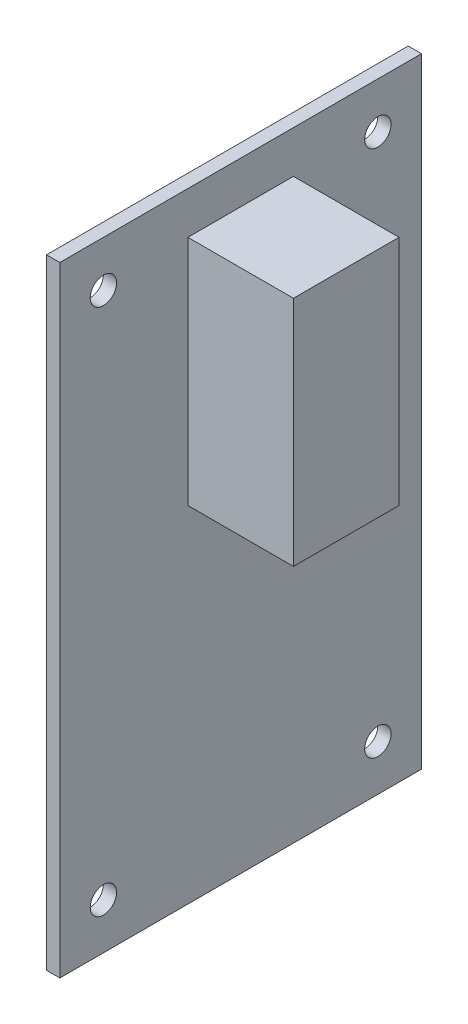
ISO-10303-21;
HEADER;
FILE_DESCRIPTION(('STEP AP214'),'2;1');
FILE_NAME('part.step','',(''),(''),'','','');
FILE_SCHEMA(('AUTOMOTIVE_DESIGN { 1 0 10303 214 1 1 1 1 }'));
ENDSEC;
DATA;
#1=APPLICATION_CONTEXT('core data for automotive mechanical design processes');
#2=APPLICATION_PROTOCOL_DEFINITION('international standard','automotive_design',2000,#1);
#3=PRODUCT_CONTEXT('',#1,'mechanical');
#4=PRODUCT('Part','Part','',(#3));
#5=PRODUCT_RELATED_PRODUCT_CATEGORY('part','',(#4));
#6=PRODUCT_DEFINITION_FORMATION('','',#4);
#7=PRODUCT_DEFINITION_CONTEXT('part definition',#1,'design');
#8=PRODUCT_DEFINITION('design','',#6,#7);
#9=PRODUCT_DEFINITION_SHAPE('','',#8);
#10=(LENGTH_UNIT() NAMED_UNIT(*) SI_UNIT(.MILLI.,.METRE.));
#11=(NAMED_UNIT(*) PLANE_ANGLE_UNIT() SI_UNIT($,.RADIAN.));
#12=(NAMED_UNIT(*) SI_UNIT($,.STERADIAN.) SOLID_ANGLE_UNIT());
#13=UNCERTAINTY_MEASURE_WITH_UNIT(LENGTH_MEASURE(1.E-05),#10,'distance_accuracy_value','');
#14=(GEOMETRIC_REPRESENTATION_CONTEXT(3) GLOBAL_UNCERTAINTY_ASSIGNED_CONTEXT((#13)) GLOBAL_UNIT_ASSIGNED_CONTEXT((#10,
#11,#12)) REPRESENTATION_CONTEXT('',''));
#15=CARTESIAN_POINT('',(0.,0.,0.));
#16=DIRECTION('',(0.,0.,1.));
#17=DIRECTION('',(1.,0.,0.));
#18=AXIS2_PLACEMENT_3D('',#15,#16,#17);
#19=CARTESIAN_POINT('',(1.6002,74.549,0.));
#20=DIRECTION('',(-1.,0.,0.));
#21=DIRECTION('',(0.,0.,1.));
#22=AXIS2_PLACEMENT_3D('',#19,#20,#21);
#23=PLANE('',#22);
#24=DIRECTION('',(0.,-1.,0.));
#25=VECTOR('',#24,1.);
#26=CARTESIAN_POINT('',(1.6002,0.,0.));
#27=LINE('',#26,#25);
#28=CARTESIAN_POINT('',(1.6002,74.549,0.));
#29=VERTEX_POINT('',#28);
#30=CARTESIAN_POINT('',(1.6002,0.,0.));
#31=VERTEX_POINT('',#30);
#32=EDGE_CURVE('E157',#29,#31,#27,.T.);
#33=ORIENTED_EDGE('',*,*,#32,.T.);
#34=DIRECTION('',(0.,0.,-1.));
#35=VECTOR('',#34,1.);
#36=CARTESIAN_POINT('',(1.6002,0.,0.));
#37=LINE('',#36,#35);
#38=CARTESIAN_POINT('',(1.6002,0.,-43.5102));
#39=VERTEX_POINT('',#38);
#40=EDGE_CURVE('E160',#31,#39,#37,.T.);
#41=ORIENTED_EDGE('',*,*,#40,.T.);
#42=DIRECTION('',(0.,1.,0.));
#43=VECTOR('',#42,1.);
#44=CARTESIAN_POINT('',(1.6002,0.,-43.5102));
#45=LINE('',#44,#43);
#46=CARTESIAN_POINT('',(1.6002,74.549,-43.5102));
#47=VERTEX_POINT('',#46);
#48=EDGE_CURVE('E162',#39,#47,#45,.T.);
#49=ORIENTED_EDGE('',*,*,#48,.T.);
#50=DIRECTION('',(0.,0.,1.));
#51=VECTOR('',#50,1.);
#52=CARTESIAN_POINT('',(1.6002,74.549,0.));
#53=LINE('',#52,#51);
#54=EDGE_CURVE('E164',#47,#29,#53,.T.);
#55=ORIENTED_EDGE('',*,*,#54,.T.);
#56=EDGE_LOOP('',(#33,#41,#49,#55));
#57=FACE_BOUND('',#56,.T.);
#58=CARTESIAN_POINT('',(1.6002,69.0245,-5.2451));
#59=DIRECTION('',(1.,0.,0.));
#60=DIRECTION('',(0.,0.,-1.));
#61=AXIS2_PLACEMENT_3D('',#58,#59,#60);
#62=CIRCLE('',#61,1.5875);
#63=CARTESIAN_POINT('',(1.6002,69.0245,-6.8326));
#64=VERTEX_POINT('',#63);
#65=EDGE_CURVE('E142',#64,#64,#62,.T.);
#66=ORIENTED_EDGE('',*,*,#65,.F.);
#67=EDGE_LOOP('',(#66));
#68=FACE_BOUND('',#67,.T.);
#69=CARTESIAN_POINT('',(1.6002,69.0245,-38.2651));
#70=DIRECTION('',(1.,0.,0.));
#71=DIRECTION('',(0.,0.,1.));
#72=AXIS2_PLACEMENT_3D('',#69,#70,#71);
#73=CIRCLE('',#72,1.58750000000002);
#74=CARTESIAN_POINT('',(1.6002,69.0245,-36.6776));
#75=VERTEX_POINT('',#74);
#76=EDGE_CURVE('E136',#75,#75,#73,.T.);
#77=ORIENTED_EDGE('',*,*,#76,.F.);
#78=EDGE_LOOP('',(#77));
#79=FACE_BOUND('',#78,.T.);
#80=CARTESIAN_POINT('',(1.6002,5.52450000000002,-38.2651));
#81=DIRECTION('',(1.,0.,0.));
#82=DIRECTION('',(0.,0.,-1.));
#83=AXIS2_PLACEMENT_3D('',#80,#81,#82);
#84=CIRCLE('',#83,1.58750000000002);
#85=CARTESIAN_POINT('',(1.6002,5.52450000000002,-39.8526));
#86=VERTEX_POINT('',#85);
#87=EDGE_CURVE('E130',#86,#86,#84,.T.);
#88=ORIENTED_EDGE('',*,*,#87,.F.);
#89=EDGE_LOOP('',(#88));
#90=FACE_BOUND('',#89,.T.);
#91=CARTESIAN_POINT('',(1.6002,5.5245,-5.2451));
#92=DIRECTION('',(1.,0.,0.));
#93=DIRECTION('',(0.,0.,1.));
#94=AXIS2_PLACEMENT_3D('',#91,#92,#93);
#95=CIRCLE('',#94,1.5875);
#96=CARTESIAN_POINT('',(1.6002,5.5245,-3.6576));
#97=VERTEX_POINT('',#96);
#98=EDGE_CURVE('E124',#97,#97,#95,.T.);
#99=ORIENTED_EDGE('',*,*,#98,.F.);
#100=EDGE_LOOP('',(#99));
#101=FACE_BOUND('',#100,.T.);
#102=DIRECTION('',(0.,-1.,0.));
#103=VECTOR('',#102,1.);
#104=CARTESIAN_POINT('',(1.6002,69.469,-15.4051));
#105=LINE('',#104,#103);
#106=CARTESIAN_POINT('',(1.6002,69.469,-15.4051));
#107=VERTEX_POINT('',#106);
#108=CARTESIAN_POINT('',(1.6002,41.529,-15.4051));
#109=VERTEX_POINT('',#108);
#110=EDGE_CURVE('E92',#107,#109,#105,.T.);
#111=ORIENTED_EDGE('',*,*,#110,.F.);
#112=DIRECTION('',(0.,0.,1.));
#113=VECTOR('',#112,1.);
#114=CARTESIAN_POINT('',(1.6002,69.469,-15.4051));
#115=LINE('',#114,#113);
#116=CARTESIAN_POINT('',(1.6002,69.469,-28.1051));
#117=VERTEX_POINT('',#116);
#118=EDGE_CURVE('E94',#117,#107,#115,.T.);
#119=ORIENTED_EDGE('',*,*,#118,.F.);
#120=DIRECTION('',(0.,1.,0.));
#121=VECTOR('',#120,1.);
#122=CARTESIAN_POINT('',(1.6002,69.469,-28.1051));
#123=LINE('',#122,#121);
#124=CARTESIAN_POINT('',(1.6002,41.529,-28.1051));
#125=VERTEX_POINT('',#124);
#126=EDGE_CURVE('E51',#125,#117,#123,.T.);
#127=ORIENTED_EDGE('',*,*,#126,.F.);
#128=DIRECTION('',(0.,0.,-1.));
#129=VECTOR('',#128,1.);
#130=CARTESIAN_POINT('',(1.6002,41.529,-15.4051));
#131=LINE('',#130,#129);
#132=EDGE_CURVE('E46',#109,#125,#131,.T.);
#133=ORIENTED_EDGE('',*,*,#132,.F.);
#134=EDGE_LOOP('',(#111,#119,#127,#133));
#135=FACE_BOUND('',#134,.T.);
#136=ADVANCED_FACE('F31',(#57,#68,#79,#90,#101,#135),#23,.F.);
#137=CARTESIAN_POINT('',(1.6002,0.,0.));
#138=DIRECTION('',(0.,0.,-1.));
#139=DIRECTION('',(-1.,0.,0.));
#140=AXIS2_PLACEMENT_3D('',#137,#138,#139);
#141=PLANE('',#140);
#142=DIRECTION('',(0.,-1.,0.));
#143=VECTOR('',#142,1.);
#144=CARTESIAN_POINT('',(0.,0.,0.));
#145=LINE('',#144,#143);
#146=CARTESIAN_POINT('',(0.,74.549,0.));
#147=VERTEX_POINT('',#146);
#148=CARTESIAN_POINT('',(0.,0.,0.));
#149=VERTEX_POINT('',#148);
#150=EDGE_CURVE('E148',#147,#149,#145,.T.);
#151=ORIENTED_EDGE('',*,*,#150,.T.);
#152=DIRECTION('',(-1.,0.,0.));
#153=VECTOR('',#152,1.);
#154=CARTESIAN_POINT('',(1.6002,0.,0.));
#155=LINE('',#154,#153);
#156=EDGE_CURVE('E11',#31,#149,#155,.T.);
#157=ORIENTED_EDGE('',*,*,#156,.F.);
#158=ORIENTED_EDGE('',*,*,#32,.F.);
#159=DIRECTION('',(-1.,0.,0.));
#160=VECTOR('',#159,1.);
#161=CARTESIAN_POINT('',(1.6002,74.549,0.));
#162=LINE('',#161,#160);
#163=EDGE_CURVE('E166',#29,#147,#162,.T.);
#164=ORIENTED_EDGE('',*,*,#163,.T.);
#165=EDGE_LOOP('',(#151,#157,#158,#164));
#166=FACE_BOUND('',#165,.T.);
#167=ADVANCED_FACE('F33',(#166),#141,.F.);
#168=CARTESIAN_POINT('',(1.6002,0.,0.));
#169=DIRECTION('',(0.,1.,0.));
#170=DIRECTION('',(0.,0.,1.));
#171=AXIS2_PLACEMENT_3D('',#168,#169,#170);
#172=PLANE('',#171);
#173=DIRECTION('',(0.,0.,-1.));
#174=VECTOR('',#173,1.);
#175=CARTESIAN_POINT('',(0.,0.,0.));
#176=LINE('',#175,#174);
#177=CARTESIAN_POINT('',(0.,0.,-43.5102));
#178=VERTEX_POINT('',#177);
#179=EDGE_CURVE('E151',#149,#178,#176,.T.);
#180=ORIENTED_EDGE('',*,*,#179,.T.);
#181=DIRECTION('',(-1.,0.,0.));
#182=VECTOR('',#181,1.);
#183=CARTESIAN_POINT('',(1.6002,0.,-43.5102));
#184=LINE('',#183,#182);
#185=EDGE_CURVE('E39',#39,#178,#184,.T.);
#186=ORIENTED_EDGE('',*,*,#185,.F.);
#187=ORIENTED_EDGE('',*,*,#40,.F.);
#188=ORIENTED_EDGE('',*,*,#156,.T.);
#189=EDGE_LOOP('',(#180,#186,#187,#188));
#190=FACE_BOUND('',#189,.T.);
#191=ADVANCED_FACE('F192',(#190),#172,.F.);
#192=CARTESIAN_POINT('',(1.6002,0.,-43.5102));
#193=DIRECTION('',(0.,0.,1.));
#194=DIRECTION('',(1.,0.,0.));
#195=AXIS2_PLACEMENT_3D('',#192,#193,#194);
#196=PLANE('',#195);
#197=DIRECTION('',(0.,1.,0.));
#198=VECTOR('',#197,1.);
#199=CARTESIAN_POINT('',(0.,0.,-43.5102));
#200=LINE('',#199,#198);
#201=CARTESIAN_POINT('',(0.,74.549,-43.5102));
#202=VERTEX_POINT('',#201);
#203=EDGE_CURVE('E153',#178,#202,#200,.T.);
#204=ORIENTED_EDGE('',*,*,#203,.T.);
#205=DIRECTION('',(-1.,0.,0.));
#206=VECTOR('',#205,1.);
#207=CARTESIAN_POINT('',(1.6002,74.549,-43.5102));
#208=LINE('',#207,#206);
#209=EDGE_CURVE('E169',#47,#202,#208,.T.);
#210=ORIENTED_EDGE('',*,*,#209,.F.);
#211=ORIENTED_EDGE('',*,*,#48,.F.);
#212=ORIENTED_EDGE('',*,*,#185,.T.);
#213=EDGE_LOOP('',(#204,#210,#211,#212));
#214=FACE_BOUND('',#213,.T.);
#215=ADVANCED_FACE('F176',(#214),#196,.F.);
#216=CARTESIAN_POINT('',(1.6002,74.549,0.));
#217=DIRECTION('',(0.,-1.,0.));
#218=DIRECTION('',(0.,0.,-1.));
#219=AXIS2_PLACEMENT_3D('',#216,#217,#218);
#220=PLANE('',#219);
#221=DIRECTION('',(0.,0.,1.));
#222=VECTOR('',#221,1.);
#223=CARTESIAN_POINT('',(0.,74.549,0.));
#224=LINE('',#223,#222);
#225=EDGE_CURVE('E155',#202,#147,#224,.T.);
#226=ORIENTED_EDGE('',*,*,#225,.T.);
#227=ORIENTED_EDGE('',*,*,#163,.F.);
#228=ORIENTED_EDGE('',*,*,#54,.F.);
#229=ORIENTED_EDGE('',*,*,#209,.T.);
#230=EDGE_LOOP('',(#226,#227,#228,#229));
#231=FACE_BOUND('',#230,.T.);
#232=ADVANCED_FACE('F185',(#231),#220,.F.);
#233=CARTESIAN_POINT('',(0.,74.549,0.));
#234=DIRECTION('',(-1.,0.,0.));
#235=DIRECTION('',(0.,0.,1.));
#236=AXIS2_PLACEMENT_3D('',#233,#234,#235);
#237=PLANE('',#236);
#238=CARTESIAN_POINT('',(0.,5.5245,-5.2451));
#239=DIRECTION('',(1.,0.,0.));
#240=DIRECTION('',(0.,0.,1.));
#241=AXIS2_PLACEMENT_3D('',#238,#239,#240);
#242=CIRCLE('',#241,1.5875);
#243=CARTESIAN_POINT('',(0.,5.5245,-3.6576));
#244=VERTEX_POINT('',#243);
#245=EDGE_CURVE('E127',#244,#244,#242,.T.);
#246=ORIENTED_EDGE('',*,*,#245,.T.);
#247=EDGE_LOOP('',(#246));
#248=FACE_BOUND('',#247,.T.);
#249=CARTESIAN_POINT('',(0.,5.52450000000002,-38.2651));
#250=DIRECTION('',(1.,0.,0.));
#251=DIRECTION('',(0.,0.,-1.));
#252=AXIS2_PLACEMENT_3D('',#249,#250,#251);
#253=CIRCLE('',#252,1.58750000000002);
#254=CARTESIAN_POINT('',(0.,5.52450000000002,-39.8526));
#255=VERTEX_POINT('',#254);
#256=EDGE_CURVE('E133',#255,#255,#253,.T.);
#257=ORIENTED_EDGE('',*,*,#256,.T.);
#258=EDGE_LOOP('',(#257));
#259=FACE_BOUND('',#258,.T.);
#260=CARTESIAN_POINT('',(0.,69.0245,-38.2651));
#261=DIRECTION('',(1.,0.,0.));
#262=DIRECTION('',(0.,0.,1.));
#263=AXIS2_PLACEMENT_3D('',#260,#261,#262);
#264=CIRCLE('',#263,1.58750000000002);
#265=CARTESIAN_POINT('',(0.,69.0245,-36.6776));
#266=VERTEX_POINT('',#265);
#267=EDGE_CURVE('E139',#266,#266,#264,.T.);
#268=ORIENTED_EDGE('',*,*,#267,.T.);
#269=EDGE_LOOP('',(#268));
#270=FACE_BOUND('',#269,.T.);
#271=CARTESIAN_POINT('',(0.,69.0245,-5.2451));
#272=DIRECTION('',(1.,0.,0.));
#273=DIRECTION('',(0.,0.,-1.));
#274=AXIS2_PLACEMENT_3D('',#271,#272,#273);
#275=CIRCLE('',#274,1.5875);
#276=CARTESIAN_POINT('',(0.,69.0245,-6.8326));
#277=VERTEX_POINT('',#276);
#278=EDGE_CURVE('E145',#277,#277,#275,.T.);
#279=ORIENTED_EDGE('',*,*,#278,.T.);
#280=EDGE_LOOP('',(#279));
#281=FACE_BOUND('',#280,.T.);
#282=ORIENTED_EDGE('',*,*,#150,.F.);
#283=ORIENTED_EDGE('',*,*,#225,.F.);
#284=ORIENTED_EDGE('',*,*,#203,.F.);
#285=ORIENTED_EDGE('',*,*,#179,.F.);
#286=EDGE_LOOP('',(#282,#283,#284,#285));
#287=FACE_BOUND('',#286,.T.);
#288=ADVANCED_FACE('F182',(#248,#259,#270,#281,#287),#237,.T.);
#289=CARTESIAN_POINT('',(0.,69.0245,-5.2451));
#290=DIRECTION('',(1.,0.,0.));
#291=DIRECTION('',(0.,0.,-1.));
#292=AXIS2_PLACEMENT_3D('',#289,#290,#291);
#293=CYLINDRICAL_SURFACE('',#292,1.5875);
#294=ORIENTED_EDGE('',*,*,#278,.F.);
#295=EDGE_LOOP('',(#294));
#296=FACE_BOUND('',#295,.T.);
#297=ORIENTED_EDGE('',*,*,#65,.T.);
#298=EDGE_LOOP('',(#297));
#299=FACE_BOUND('',#298,.T.);
#300=ADVANCED_FACE('F210',(#296,#299),#293,.F.);
#301=CARTESIAN_POINT('',(0.,69.0245,-38.2651));
#302=DIRECTION('',(1.,0.,0.));
#303=DIRECTION('',(0.,0.,-1.));
#304=AXIS2_PLACEMENT_3D('',#301,#302,#303);
#305=CYLINDRICAL_SURFACE('',#304,1.58750000000002);
#306=ORIENTED_EDGE('',*,*,#267,.F.);
#307=EDGE_LOOP('',(#306));
#308=FACE_BOUND('',#307,.T.);
#309=ORIENTED_EDGE('',*,*,#76,.T.);
#310=EDGE_LOOP('',(#309));
#311=FACE_BOUND('',#310,.T.);
#312=ADVANCED_FACE('F215',(#308,#311),#305,.F.);
#313=CARTESIAN_POINT('',(0.,5.52450000000002,-38.2651));
#314=DIRECTION('',(1.,0.,0.));
#315=DIRECTION('',(0.,0.,-1.));
#316=AXIS2_PLACEMENT_3D('',#313,#314,#315);
#317=CYLINDRICAL_SURFACE('',#316,1.58750000000002);
#318=ORIENTED_EDGE('',*,*,#256,.F.);
#319=EDGE_LOOP('',(#318));
#320=FACE_BOUND('',#319,.T.);
#321=ORIENTED_EDGE('',*,*,#87,.T.);
#322=EDGE_LOOP('',(#321));
#323=FACE_BOUND('',#322,.T.);
#324=ADVANCED_FACE('F235',(#320,#323),#317,.F.);
#325=CARTESIAN_POINT('',(0.,5.5245,-5.2451));
#326=DIRECTION('',(1.,0.,0.));
#327=DIRECTION('',(0.,0.,-1.));
#328=AXIS2_PLACEMENT_3D('',#325,#326,#327);
#329=CYLINDRICAL_SURFACE('',#328,1.5875);
#330=ORIENTED_EDGE('',*,*,#245,.F.);
#331=EDGE_LOOP('',(#330));
#332=FACE_BOUND('',#331,.T.);
#333=ORIENTED_EDGE('',*,*,#98,.T.);
#334=EDGE_LOOP('',(#333));
#335=FACE_BOUND('',#334,.T.);
#336=ADVANCED_FACE('F233',(#332,#335),#329,.F.);
#337=CARTESIAN_POINT('',(14.3002,69.469,-15.4051));
#338=DIRECTION('',(0.,0.,-1.));
#339=DIRECTION('',(0.,1.,0.));
#340=AXIS2_PLACEMENT_3D('',#337,#338,#339);
#341=PLANE('',#340);
#342=ORIENTED_EDGE('',*,*,#110,.T.);
#343=DIRECTION('',(-1.,0.,0.));
#344=VECTOR('',#343,1.);
#345=CARTESIAN_POINT('',(14.3002,41.529,-15.4051));
#346=LINE('',#345,#344);
#347=CARTESIAN_POINT('',(14.3002,41.529,-15.4051));
#348=VERTEX_POINT('',#347);
#349=EDGE_CURVE('E122',#348,#109,#346,.T.);
#350=ORIENTED_EDGE('',*,*,#349,.F.);
#351=DIRECTION('',(0.,-1.,0.));
#352=VECTOR('',#351,1.);
#353=CARTESIAN_POINT('',(14.3002,69.469,-15.4051));
#354=LINE('',#353,#352);
#355=CARTESIAN_POINT('',(14.3002,69.469,-15.4051));
#356=VERTEX_POINT('',#355);
#357=EDGE_CURVE('E108',#356,#348,#354,.T.);
#358=ORIENTED_EDGE('',*,*,#357,.F.);
#359=DIRECTION('',(-1.,0.,0.));
#360=VECTOR('',#359,1.);
#361=CARTESIAN_POINT('',(14.3002,69.469,-15.4051));
#362=LINE('',#361,#360);
#363=EDGE_CURVE('E104',#356,#107,#362,.T.);
#364=ORIENTED_EDGE('',*,*,#363,.T.);
#365=EDGE_LOOP('',(#342,#350,#358,#364));
#366=FACE_BOUND('',#365,.T.);
#367=ADVANCED_FACE('F110',(#366),#341,.F.);
#368=CARTESIAN_POINT('',(14.3002,41.529,-15.4051));
#369=DIRECTION('',(0.,1.,0.));
#370=DIRECTION('',(0.,0.,1.));
#371=AXIS2_PLACEMENT_3D('',#368,#369,#370);
#372=PLANE('',#371);
#373=ORIENTED_EDGE('',*,*,#132,.T.);
#374=DIRECTION('',(-1.,0.,0.));
#375=VECTOR('',#374,1.);
#376=CARTESIAN_POINT('',(14.3002,41.529,-28.1051));
#377=LINE('',#376,#375);
#378=CARTESIAN_POINT('',(14.3002,41.529,-28.1051));
#379=VERTEX_POINT('',#378);
#380=EDGE_CURVE('E114',#379,#125,#377,.T.);
#381=ORIENTED_EDGE('',*,*,#380,.F.);
#382=DIRECTION('',(0.,0.,-1.));
#383=VECTOR('',#382,1.);
#384=CARTESIAN_POINT('',(14.3002,41.529,-15.4051));
#385=LINE('',#384,#383);
#386=EDGE_CURVE('E313',#348,#379,#385,.T.);
#387=ORIENTED_EDGE('',*,*,#386,.F.);
#388=ORIENTED_EDGE('',*,*,#349,.T.);
#389=EDGE_LOOP('',(#373,#381,#387,#388));
#390=FACE_BOUND('',#389,.T.);
#391=ADVANCED_FACE('F242',(#390),#372,.F.);
#392=CARTESIAN_POINT('',(14.3002,69.469,-28.1051));
#393=DIRECTION('',(0.,0.,1.));
#394=DIRECTION('',(0.,-1.,0.));
#395=AXIS2_PLACEMENT_3D('',#392,#393,#394);
#396=PLANE('',#395);
#397=ORIENTED_EDGE('',*,*,#126,.T.);
#398=DIRECTION('',(-1.,0.,0.));
#399=VECTOR('',#398,1.);
#400=CARTESIAN_POINT('',(14.3002,69.469,-28.1051));
#401=LINE('',#400,#399);
#402=CARTESIAN_POINT('',(14.3002,69.469,-28.1051));
#403=VERTEX_POINT('',#402);
#404=EDGE_CURVE('E107',#403,#117,#401,.T.);
#405=ORIENTED_EDGE('',*,*,#404,.F.);
#406=DIRECTION('',(0.,1.,0.));
#407=VECTOR('',#406,1.);
#408=CARTESIAN_POINT('',(14.3002,69.469,-28.1051));
#409=LINE('',#408,#407);
#410=EDGE_CURVE('E116',#379,#403,#409,.T.);
#411=ORIENTED_EDGE('',*,*,#410,.F.);
#412=ORIENTED_EDGE('',*,*,#380,.T.);
#413=EDGE_LOOP('',(#397,#405,#411,#412));
#414=FACE_BOUND('',#413,.T.);
#415=ADVANCED_FACE('F282',(#414),#396,.F.);
#416=CARTESIAN_POINT('',(14.3002,69.469,-15.4051));
#417=DIRECTION('',(0.,-1.,0.));
#418=DIRECTION('',(0.,0.,-1.));
#419=AXIS2_PLACEMENT_3D('',#416,#417,#418);
#420=PLANE('',#419);
#421=ORIENTED_EDGE('',*,*,#118,.T.);
#422=ORIENTED_EDGE('',*,*,#363,.F.);
#423=DIRECTION('',(0.,0.,1.));
#424=VECTOR('',#423,1.);
#425=CARTESIAN_POINT('',(14.3002,69.469,-15.4051));
#426=LINE('',#425,#424);
#427=EDGE_CURVE('E112',#403,#356,#426,.T.);
#428=ORIENTED_EDGE('',*,*,#427,.F.);
#429=ORIENTED_EDGE('',*,*,#404,.T.);
#430=EDGE_LOOP('',(#421,#422,#428,#429));
#431=FACE_BOUND('',#430,.T.);
#432=ADVANCED_FACE('F102',(#431),#420,.F.);
#433=CARTESIAN_POINT('',(14.3002,69.469,-15.4051));
#434=DIRECTION('',(1.,0.,0.));
#435=DIRECTION('',(0.,0.,-1.));
#436=AXIS2_PLACEMENT_3D('',#433,#434,#435);
#437=PLANE('',#436);
#438=ORIENTED_EDGE('',*,*,#357,.T.);
#439=ORIENTED_EDGE('',*,*,#386,.T.);
#440=ORIENTED_EDGE('',*,*,#410,.T.);
#441=ORIENTED_EDGE('',*,*,#427,.T.);
#442=EDGE_LOOP('',(#438,#439,#440,#441));
#443=FACE_BOUND('',#442,.T.);
#444=ADVANCED_FACE('F300',(#443),#437,.T.);
#445=CLOSED_SHELL('',(#136,#167,#191,#215,#232,#288,#300,#312,#324,#336,#367,#391,#415,#432,#444));
#446=MANIFOLD_SOLID_BREP('B2',#445);
#447=ADVANCED_BREP_SHAPE_REPRESENTATION('',(#18,#446),#14);
#448=SHAPE_DEFINITION_REPRESENTATION(#9,#447);
ENDSEC;
END-ISO-10303-21;
